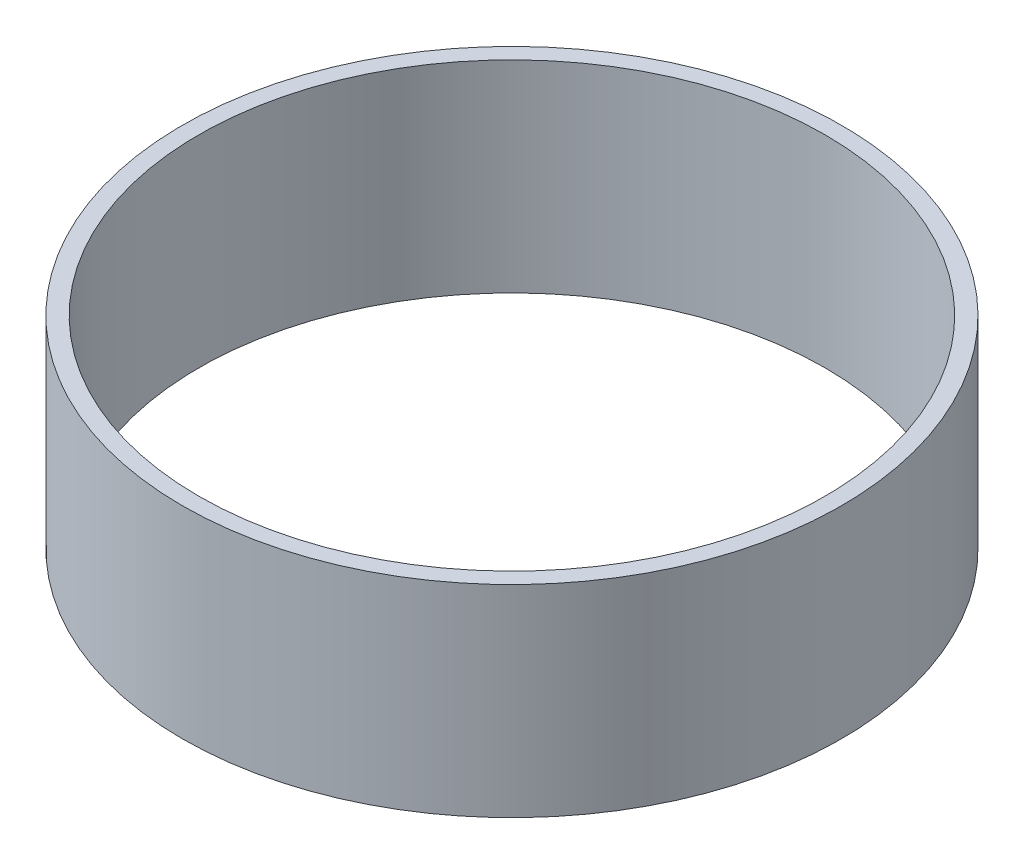
ISO-10303-21;
HEADER;
FILE_DESCRIPTION(('STEP AP214'),'2;1');
FILE_NAME('part.step','',(''),(''),'','','');
FILE_SCHEMA(('AUTOMOTIVE_DESIGN { 1 0 10303 214 1 1 1 1 }'));
ENDSEC;
DATA;
#1=APPLICATION_CONTEXT('core data for automotive mechanical design processes');
#2=APPLICATION_PROTOCOL_DEFINITION('international standard','automotive_design',2000,#1);
#3=PRODUCT_CONTEXT('',#1,'mechanical');
#4=PRODUCT('Part','Part','',(#3));
#5=PRODUCT_RELATED_PRODUCT_CATEGORY('part','',(#4));
#6=PRODUCT_DEFINITION_FORMATION('','',#4);
#7=PRODUCT_DEFINITION_CONTEXT('part definition',#1,'design');
#8=PRODUCT_DEFINITION('design','',#6,#7);
#9=PRODUCT_DEFINITION_SHAPE('','',#8);
#10=(LENGTH_UNIT() NAMED_UNIT(*) SI_UNIT(.MILLI.,.METRE.));
#11=(NAMED_UNIT(*) PLANE_ANGLE_UNIT() SI_UNIT($,.RADIAN.));
#12=(NAMED_UNIT(*) SI_UNIT($,.STERADIAN.) SOLID_ANGLE_UNIT());
#13=UNCERTAINTY_MEASURE_WITH_UNIT(LENGTH_MEASURE(1.E-05),#10,'distance_accuracy_value','');
#14=(GEOMETRIC_REPRESENTATION_CONTEXT(3) GLOBAL_UNCERTAINTY_ASSIGNED_CONTEXT((#13)) GLOBAL_UNIT_ASSIGNED_CONTEXT((#10,
#11,#12)) REPRESENTATION_CONTEXT('',''));
#15=CARTESIAN_POINT('',(0.,0.,0.));
#16=DIRECTION('',(0.,0.,1.));
#17=DIRECTION('',(1.,0.,0.));
#18=AXIS2_PLACEMENT_3D('',#15,#16,#17);
#19=CARTESIAN_POINT('',(0.,24.5,0.));
#20=DIRECTION('',(0.,1.,0.));
#21=DIRECTION('',(0.,0.,1.));
#22=AXIS2_PLACEMENT_3D('',#19,#20,#21);
#23=PLANE('',#22);
#24=CARTESIAN_POINT('',(0.,24.5,0.));
#25=DIRECTION('',(0.,1.,0.));
#26=DIRECTION('',(0.,0.,1.));
#27=AXIS2_PLACEMENT_3D('',#24,#25,#26);
#28=CIRCLE('',#27,40.);
#29=CARTESIAN_POINT('',(0.,24.5,40.));
#30=VERTEX_POINT('',#29);
#31=EDGE_CURVE('E10',#30,#30,#28,.T.);
#32=ORIENTED_EDGE('',*,*,#31,.T.);
#33=EDGE_LOOP('',(#32));
#34=FACE_BOUND('',#33,.T.);
#35=CARTESIAN_POINT('',(0.,24.5,0.));
#36=DIRECTION('',(0.,1.,0.));
#37=DIRECTION('',(0.,0.,1.));
#38=AXIS2_PLACEMENT_3D('',#35,#36,#37);
#39=CIRCLE('',#38,38.);
#40=CARTESIAN_POINT('',(0.,24.5,38.));
#41=VERTEX_POINT('',#40);
#42=EDGE_CURVE('E52',#41,#41,#39,.T.);
#43=ORIENTED_EDGE('',*,*,#42,.F.);
#44=EDGE_LOOP('',(#43));
#45=FACE_BOUND('',#44,.T.);
#46=ADVANCED_FACE('F39',(#34,#45),#23,.T.);
#47=CARTESIAN_POINT('',(0.,0.,0.));
#48=DIRECTION('',(0.,1.,0.));
#49=DIRECTION('',(0.,0.,1.));
#50=AXIS2_PLACEMENT_3D('',#47,#48,#49);
#51=PLANE('',#50);
#52=CARTESIAN_POINT('',(0.,0.,0.));
#53=DIRECTION('',(0.,1.,0.));
#54=DIRECTION('',(0.,0.,1.));
#55=AXIS2_PLACEMENT_3D('',#52,#53,#54);
#56=CIRCLE('',#55,40.);
#57=CARTESIAN_POINT('',(0.,0.,40.));
#58=VERTEX_POINT('',#57);
#59=EDGE_CURVE('E43',#58,#58,#56,.T.);
#60=ORIENTED_EDGE('',*,*,#59,.F.);
#61=EDGE_LOOP('',(#60));
#62=FACE_BOUND('',#61,.T.);
#63=CARTESIAN_POINT('',(0.,0.,0.));
#64=DIRECTION('',(0.,1.,0.));
#65=DIRECTION('',(0.,0.,1.));
#66=AXIS2_PLACEMENT_3D('',#63,#64,#65);
#67=CIRCLE('',#66,38.);
#68=CARTESIAN_POINT('',(0.,0.,38.));
#69=VERTEX_POINT('',#68);
#70=EDGE_CURVE('E54',#69,#69,#67,.T.);
#71=ORIENTED_EDGE('',*,*,#70,.T.);
#72=EDGE_LOOP('',(#71));
#73=FACE_BOUND('',#72,.T.);
#74=ADVANCED_FACE('F66',(#62,#73),#51,.F.);
#75=CARTESIAN_POINT('',(0.,24.5,0.));
#76=DIRECTION('',(0.,-1.,0.));
#77=DIRECTION('',(0.,0.,-1.));
#78=AXIS2_PLACEMENT_3D('',#75,#76,#77);
#79=CYLINDRICAL_SURFACE('',#78,40.);
#80=ORIENTED_EDGE('',*,*,#31,.F.);
#81=EDGE_LOOP('',(#80));
#82=FACE_BOUND('',#81,.T.);
#83=ORIENTED_EDGE('',*,*,#59,.T.);
#84=EDGE_LOOP('',(#83));
#85=FACE_BOUND('',#84,.T.);
#86=ADVANCED_FACE('F41',(#82,#85),#79,.T.);
#87=CARTESIAN_POINT('',(0.,24.5,0.));
#88=DIRECTION('',(0.,-1.,0.));
#89=DIRECTION('',(0.,0.,-1.));
#90=AXIS2_PLACEMENT_3D('',#87,#88,#89);
#91=CYLINDRICAL_SURFACE('',#90,38.);
#92=ORIENTED_EDGE('',*,*,#42,.T.);
#93=EDGE_LOOP('',(#92));
#94=FACE_BOUND('',#93,.T.);
#95=ORIENTED_EDGE('',*,*,#70,.F.);
#96=EDGE_LOOP('',(#95));
#97=FACE_BOUND('',#96,.T.);
#98=ADVANCED_FACE('F62',(#94,#97),#91,.F.);
#99=CLOSED_SHELL('',(#46,#74,#86,#98));
#100=MANIFOLD_SOLID_BREP('B2',#99);
#101=ADVANCED_BREP_SHAPE_REPRESENTATION('',(#18,#100),#14);
#102=SHAPE_DEFINITION_REPRESENTATION(#9,#101);
ENDSEC;
END-ISO-10303-21;
